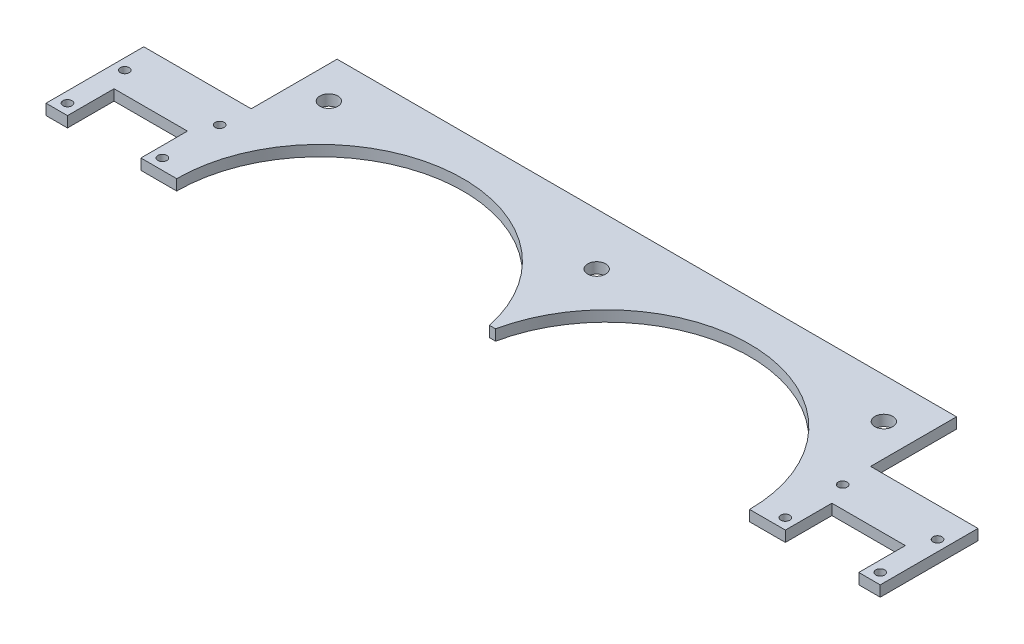
ISO-10303-21;
HEADER;
FILE_DESCRIPTION(('STEP AP214'),'2;1');
FILE_NAME('part.step','',(''),(''),'','','');
FILE_SCHEMA(('AUTOMOTIVE_DESIGN { 1 0 10303 214 1 1 1 1 }'));
ENDSEC;
DATA;
#1=APPLICATION_CONTEXT('core data for automotive mechanical design processes');
#2=APPLICATION_PROTOCOL_DEFINITION('international standard','automotive_design',2000,#1);
#3=PRODUCT_CONTEXT('',#1,'mechanical');
#4=PRODUCT('Part','Part','',(#3));
#5=PRODUCT_RELATED_PRODUCT_CATEGORY('part','',(#4));
#6=PRODUCT_DEFINITION_FORMATION('','',#4);
#7=PRODUCT_DEFINITION_CONTEXT('part definition',#1,'design');
#8=PRODUCT_DEFINITION('design','',#6,#7);
#9=PRODUCT_DEFINITION_SHAPE('','',#8);
#10=(LENGTH_UNIT() NAMED_UNIT(*) SI_UNIT(.MILLI.,.METRE.));
#11=(NAMED_UNIT(*) PLANE_ANGLE_UNIT() SI_UNIT($,.RADIAN.));
#12=(NAMED_UNIT(*) SI_UNIT($,.STERADIAN.) SOLID_ANGLE_UNIT());
#13=UNCERTAINTY_MEASURE_WITH_UNIT(LENGTH_MEASURE(1.E-05),#10,'distance_accuracy_value','');
#14=(GEOMETRIC_REPRESENTATION_CONTEXT(3) GLOBAL_UNCERTAINTY_ASSIGNED_CONTEXT((#13)) GLOBAL_UNIT_ASSIGNED_CONTEXT((#10,
#11,#12)) REPRESENTATION_CONTEXT('',''));
#15=CARTESIAN_POINT('',(0.,0.,0.));
#16=DIRECTION('',(0.,0.,1.));
#17=DIRECTION('',(1.,0.,0.));
#18=AXIS2_PLACEMENT_3D('',#15,#16,#17);
#19=CARTESIAN_POINT('',(37.249673487951,3.,-8.79518226927519));
#20=DIRECTION('',(0.,1.,0.));
#21=DIRECTION('',(0.,0.,1.));
#22=AXIS2_PLACEMENT_3D('',#19,#20,#21);
#23=PLANE('',#22);
#24=CARTESIAN_POINT('',(-89.7503265120491,3.,-27.7951822692752));
#25=DIRECTION('',(0.,1.,0.));
#26=DIRECTION('',(0.,0.,1.));
#27=AXIS2_PLACEMENT_3D('',#24,#25,#26);
#28=CIRCLE('',#27,1.25);
#29=CARTESIAN_POINT('',(-89.7503265120491,3.,-26.5451822692752));
#30=VERTEX_POINT('',#29);
#31=EDGE_CURVE('E422',#30,#30,#28,.T.);
#32=ORIENTED_EDGE('',*,*,#31,.F.);
#33=EDGE_LOOP('',(#32));
#34=FACE_BOUND('',#33,.T.);
#35=CARTESIAN_POINT('',(74.749673487951,3.,-48.7951822692752));
#36=DIRECTION('',(0.,1.,0.));
#37=DIRECTION('',(0.,0.,-1.));
#38=AXIS2_PLACEMENT_3D('',#35,#36,#37);
#39=CIRCLE('',#38,2.50000000000001);
#40=CARTESIAN_POINT('',(74.749673487951,3.,-51.2951822692752));
#41=VERTEX_POINT('',#40);
#42=EDGE_CURVE('E434',#41,#41,#39,.T.);
#43=ORIENTED_EDGE('',*,*,#42,.F.);
#44=EDGE_LOOP('',(#43));
#45=FACE_BOUND('',#44,.T.);
#46=CARTESIAN_POINT('',(84.249673487951,3.,-27.7951822692752));
#47=DIRECTION('',(0.,1.,0.));
#48=DIRECTION('',(0.,0.,-1.));
#49=AXIS2_PLACEMENT_3D('',#46,#47,#48);
#50=CIRCLE('',#49,1.25);
#51=CARTESIAN_POINT('',(84.249673487951,3.,-29.0451822692752));
#52=VERTEX_POINT('',#51);
#53=EDGE_CURVE('E446',#52,#52,#50,.T.);
#54=ORIENTED_EDGE('',*,*,#53,.F.);
#55=EDGE_LOOP('',(#54));
#56=FACE_BOUND('',#55,.T.);
#57=CARTESIAN_POINT('',(-80.2503265120491,3.,-48.7951822692752));
#58=DIRECTION('',(0.,1.,0.));
#59=DIRECTION('',(0.,0.,1.));
#60=AXIS2_PLACEMENT_3D('',#57,#58,#59);
#61=CIRCLE('',#60,2.50000000000001);
#62=CARTESIAN_POINT('',(-80.2503265120491,3.,-46.2951822692752));
#63=VERTEX_POINT('',#62);
#64=EDGE_CURVE('E458',#63,#63,#61,.T.);
#65=ORIENTED_EDGE('',*,*,#64,.F.);
#66=EDGE_LOOP('',(#65));
#67=FACE_BOUND('',#66,.T.);
#68=CARTESIAN_POINT('',(-89.7503265120491,3.,-11.7951822692752));
#69=DIRECTION('',(0.,1.,0.));
#70=DIRECTION('',(0.,0.,1.));
#71=AXIS2_PLACEMENT_3D('',#68,#69,#70);
#72=CIRCLE('',#71,1.25);
#73=CARTESIAN_POINT('',(-89.7503265120491,3.,-10.5451822692752));
#74=VERTEX_POINT('',#73);
#75=EDGE_CURVE('E470',#74,#74,#72,.T.);
#76=ORIENTED_EDGE('',*,*,#75,.F.);
#77=EDGE_LOOP('',(#76));
#78=FACE_BOUND('',#77,.T.);
#79=DIRECTION('',(0.,0.,1.));
#80=VECTOR('',#79,1.);
#81=CARTESIAN_POINT('',(-119.250326512049,3.,-8.79518226927519));
#82=LINE('',#81,#80);
#83=CARTESIAN_POINT('',(-119.250326512049,3.,-36.0990182873039));
#84=VERTEX_POINT('',#83);
#85=CARTESIAN_POINT('',(-119.250326512049,3.,-8.79518226927519));
#86=VERTEX_POINT('',#85);
#87=EDGE_CURVE('E239',#84,#86,#82,.T.);
#88=ORIENTED_EDGE('',*,*,#87,.T.);
#89=DIRECTION('',(1.,0.,0.));
#90=VECTOR('',#89,1.);
#91=CARTESIAN_POINT('',(-119.250326512049,3.,-8.79518226927519));
#92=LINE('',#91,#90);
#93=CARTESIAN_POINT('',(-113.250326512049,3.,-8.79518226927519));
#94=VERTEX_POINT('',#93);
#95=EDGE_CURVE('E127',#86,#94,#92,.T.);
#96=ORIENTED_EDGE('',*,*,#95,.T.);
#97=DIRECTION('',(0.,0.,-1.));
#98=VECTOR('',#97,1.);
#99=CARTESIAN_POINT('',(-113.250326512049,3.,-8.79518226927519));
#100=LINE('',#99,#98);
#101=CARTESIAN_POINT('',(-113.250326512049,3.,-21.7951822692752));
#102=VERTEX_POINT('',#101);
#103=EDGE_CURVE('E290',#94,#102,#100,.T.);
#104=ORIENTED_EDGE('',*,*,#103,.T.);
#105=DIRECTION('',(1.,0.,0.));
#106=VECTOR('',#105,1.);
#107=CARTESIAN_POINT('',(-113.250326512049,3.,-21.7951822692752));
#108=LINE('',#107,#106);
#109=CARTESIAN_POINT('',(-92.7503265120491,3.,-21.7951822692752));
#110=VERTEX_POINT('',#109);
#111=EDGE_CURVE('E309',#102,#110,#108,.T.);
#112=ORIENTED_EDGE('',*,*,#111,.T.);
#113=DIRECTION('',(0.,0.,1.));
#114=VECTOR('',#113,1.);
#115=CARTESIAN_POINT('',(-92.7503265120491,3.,-21.7951822692752));
#116=LINE('',#115,#114);
#117=CARTESIAN_POINT('',(-92.7503265120491,3.,-8.79518226927519));
#118=VERTEX_POINT('',#117);
#119=EDGE_CURVE('E306',#110,#118,#116,.T.);
#120=ORIENTED_EDGE('',*,*,#119,.T.);
#121=DIRECTION('',(1.,0.,0.));
#122=VECTOR('',#121,1.);
#123=CARTESIAN_POINT('',(-92.7503265120491,3.,-8.79518226927519));
#124=LINE('',#123,#122);
#125=CARTESIAN_POINT('',(-82.7503265120491,3.,-8.79518226927519));
#126=VERTEX_POINT('',#125);
#127=EDGE_CURVE('E308',#118,#126,#124,.T.);
#128=ORIENTED_EDGE('',*,*,#127,.T.);
#129=CARTESIAN_POINT('',(-42.7503265120491,3.,-8.79518226927519));
#130=DIRECTION('',(0.,-1.,0.));
#131=DIRECTION('',(0.,0.,-1.));
#132=AXIS2_PLACEMENT_3D('',#129,#130,#131);
#133=CIRCLE('',#132,40.);
#134=CARTESIAN_POINT('',(-3.60098437356102,3.,-17.0006079208551));
#135=VERTEX_POINT('',#134);
#136=EDGE_CURVE('E311',#126,#135,#133,.T.);
#137=ORIENTED_EDGE('',*,*,#136,.T.);
#138=DIRECTION('',(1.,0.,0.));
#139=VECTOR('',#138,1.);
#140=CARTESIAN_POINT('',(-3.60098437356102,3.,-17.000607920855));
#141=LINE('',#140,#139);
#142=CARTESIAN_POINT('',(-1.8996686505371,3.,-17.000607920855));
#143=VERTEX_POINT('',#142);
#144=EDGE_CURVE('E317',#135,#143,#141,.T.);
#145=ORIENTED_EDGE('',*,*,#144,.T.);
#146=CARTESIAN_POINT('',(37.249673487951,3.,-8.79518226927519));
#147=DIRECTION('',(0.,-1.,0.));
#148=DIRECTION('',(0.,0.,1.));
#149=AXIS2_PLACEMENT_3D('',#146,#147,#148);
#150=CIRCLE('',#149,40.);
#151=CARTESIAN_POINT('',(77.2496734879509,3.,-8.79518226927519));
#152=VERTEX_POINT('',#151);
#153=EDGE_CURVE('E319',#143,#152,#150,.T.);
#154=ORIENTED_EDGE('',*,*,#153,.T.);
#155=DIRECTION('',(1.,0.,0.));
#156=VECTOR('',#155,1.);
#157=CARTESIAN_POINT('',(87.249673487951,3.,-8.79518226927519));
#158=LINE('',#157,#156);
#159=CARTESIAN_POINT('',(87.249673487951,3.,-8.79518226927519));
#160=VERTEX_POINT('',#159);
#161=EDGE_CURVE('E321',#152,#160,#158,.T.);
#162=ORIENTED_EDGE('',*,*,#161,.T.);
#163=DIRECTION('',(0.,0.,-1.));
#164=VECTOR('',#163,1.);
#165=CARTESIAN_POINT('',(87.249673487951,3.,-21.7951822692752));
#166=LINE('',#165,#164);
#167=CARTESIAN_POINT('',(87.249673487951,3.,-21.7951822692752));
#168=VERTEX_POINT('',#167);
#169=EDGE_CURVE('E323',#160,#168,#166,.T.);
#170=ORIENTED_EDGE('',*,*,#169,.T.);
#171=DIRECTION('',(1.,0.,0.));
#172=VECTOR('',#171,1.);
#173=CARTESIAN_POINT('',(107.749673487951,3.,-21.7951822692752));
#174=LINE('',#173,#172);
#175=CARTESIAN_POINT('',(107.749673487951,3.,-21.7951822692752));
#176=VERTEX_POINT('',#175);
#177=EDGE_CURVE('E325',#168,#176,#174,.T.);
#178=ORIENTED_EDGE('',*,*,#177,.T.);
#179=DIRECTION('',(0.,0.,1.));
#180=VECTOR('',#179,1.);
#181=CARTESIAN_POINT('',(107.749673487951,3.,-8.79518226927519));
#182=LINE('',#181,#180);
#183=CARTESIAN_POINT('',(107.749673487951,3.,-8.79518226927519));
#184=VERTEX_POINT('',#183);
#185=EDGE_CURVE('E327',#176,#184,#182,.T.);
#186=ORIENTED_EDGE('',*,*,#185,.T.);
#187=DIRECTION('',(1.,0.,0.));
#188=VECTOR('',#187,1.);
#189=CARTESIAN_POINT('',(113.749673487951,3.,-8.79518226927519));
#190=LINE('',#189,#188);
#191=CARTESIAN_POINT('',(113.749673487951,3.,-8.79518226927519));
#192=VERTEX_POINT('',#191);
#193=EDGE_CURVE('E329',#184,#192,#190,.T.);
#194=ORIENTED_EDGE('',*,*,#193,.T.);
#195=DIRECTION('',(0.,0.,-1.));
#196=VECTOR('',#195,1.);
#197=CARTESIAN_POINT('',(113.749673487951,3.,-8.79518226927519));
#198=LINE('',#197,#196);
#199=CARTESIAN_POINT('',(113.749673487951,3.,-36.0990182873039));
#200=VERTEX_POINT('',#199);
#201=EDGE_CURVE('E331',#192,#200,#198,.T.);
#202=ORIENTED_EDGE('',*,*,#201,.T.);
#203=DIRECTION('',(-1.,0.,0.));
#204=VECTOR('',#203,1.);
#205=CARTESIAN_POINT('',(113.749673487951,3.,-36.0990182873039));
#206=LINE('',#205,#204);
#207=CARTESIAN_POINT('',(83.749673487951,3.,-36.0990182873039));
#208=VERTEX_POINT('',#207);
#209=EDGE_CURVE('E333',#200,#208,#206,.T.);
#210=ORIENTED_EDGE('',*,*,#209,.T.);
#211=DIRECTION('',(0.,0.,-1.));
#212=VECTOR('',#211,1.);
#213=CARTESIAN_POINT('',(83.749673487951,3.,-36.0990182873039));
#214=LINE('',#213,#212);
#215=CARTESIAN_POINT('',(83.749673487951,3.,-60.0990182873039));
#216=VERTEX_POINT('',#215);
#217=EDGE_CURVE('E182',#208,#216,#214,.T.);
#218=ORIENTED_EDGE('',*,*,#217,.T.);
#219=DIRECTION('',(-1.,0.,0.));
#220=VECTOR('',#219,1.);
#221=CARTESIAN_POINT('',(-89.2503265120491,3.,-60.0990182873039));
#222=LINE('',#221,#220);
#223=CARTESIAN_POINT('',(-89.2503265120491,3.,-60.0990182873039));
#224=VERTEX_POINT('',#223);
#225=EDGE_CURVE('E176',#216,#224,#222,.T.);
#226=ORIENTED_EDGE('',*,*,#225,.T.);
#227=DIRECTION('',(0.,0.,1.));
#228=VECTOR('',#227,1.);
#229=CARTESIAN_POINT('',(-89.2503265120491,3.,-36.0990182873039));
#230=LINE('',#229,#228);
#231=CARTESIAN_POINT('',(-89.2503265120491,3.,-36.0990182873039));
#232=VERTEX_POINT('',#231);
#233=EDGE_CURVE('E180',#224,#232,#230,.T.);
#234=ORIENTED_EDGE('',*,*,#233,.T.);
#235=DIRECTION('',(-1.,0.,0.));
#236=VECTOR('',#235,1.);
#237=CARTESIAN_POINT('',(-119.250326512049,3.,-36.0990182873039));
#238=LINE('',#237,#236);
#239=EDGE_CURVE('E48',#232,#84,#238,.T.);
#240=ORIENTED_EDGE('',*,*,#239,.T.);
#241=EDGE_LOOP('',(#88,#96,#104,#112,#120,#128,#137,#145,#154,#162,#170,#178,#186,#194,#202,
#210,#218,#226,#234,#240));
#242=FACE_BOUND('',#241,.T.);
#243=CARTESIAN_POINT('',(84.249673487951,3.,-11.7951822692752));
#244=DIRECTION('',(0.,1.,0.));
#245=DIRECTION('',(0.,0.,-1.));
#246=AXIS2_PLACEMENT_3D('',#243,#244,#245);
#247=CIRCLE('',#246,1.25);
#248=CARTESIAN_POINT('',(84.249673487951,3.,-13.0451822692752));
#249=VERTEX_POINT('',#248);
#250=EDGE_CURVE('E204',#249,#249,#247,.T.);
#251=ORIENTED_EDGE('',*,*,#250,.F.);
#252=EDGE_LOOP('',(#251));
#253=FACE_BOUND('',#252,.T.);
#254=CARTESIAN_POINT('',(-2.25032651204908,3.,-45.5990182873039));
#255=DIRECTION('',(0.,1.,0.));
#256=DIRECTION('',(0.,0.,1.));
#257=AXIS2_PLACEMENT_3D('',#254,#255,#256);
#258=CIRCLE('',#257,2.5);
#259=CARTESIAN_POINT('',(-2.25032651204908,3.,-43.0990182873039));
#260=VERTEX_POINT('',#259);
#261=EDGE_CURVE('E464',#260,#260,#258,.T.);
#262=ORIENTED_EDGE('',*,*,#261,.F.);
#263=EDGE_LOOP('',(#262));
#264=FACE_BOUND('',#263,.T.);
#265=CARTESIAN_POINT('',(110.749673487951,3.,-11.7951822692752));
#266=DIRECTION('',(0.,1.,0.));
#267=DIRECTION('',(0.,0.,-1.));
#268=AXIS2_PLACEMENT_3D('',#265,#266,#267);
#269=CIRCLE('',#268,1.25000000000001);
#270=CARTESIAN_POINT('',(110.749673487951,3.,-13.0451822692752));
#271=VERTEX_POINT('',#270);
#272=EDGE_CURVE('E452',#271,#271,#269,.T.);
#273=ORIENTED_EDGE('',*,*,#272,.F.);
#274=EDGE_LOOP('',(#273));
#275=FACE_BOUND('',#274,.T.);
#276=CARTESIAN_POINT('',(110.749673487951,3.,-27.7951822692752));
#277=DIRECTION('',(0.,1.,0.));
#278=DIRECTION('',(0.,0.,-1.));
#279=AXIS2_PLACEMENT_3D('',#276,#277,#278);
#280=CIRCLE('',#279,1.25000000000001);
#281=CARTESIAN_POINT('',(110.749673487951,3.,-29.0451822692752));
#282=VERTEX_POINT('',#281);
#283=EDGE_CURVE('E440',#282,#282,#280,.T.);
#284=ORIENTED_EDGE('',*,*,#283,.F.);
#285=EDGE_LOOP('',(#284));
#286=FACE_BOUND('',#285,.T.);
#287=CARTESIAN_POINT('',(-116.250326512049,3.,-27.7951822692752));
#288=DIRECTION('',(0.,1.,0.));
#289=DIRECTION('',(0.,0.,1.));
#290=AXIS2_PLACEMENT_3D('',#287,#288,#289);
#291=CIRCLE('',#290,1.25000000000001);
#292=CARTESIAN_POINT('',(-116.250326512049,3.,-26.5451822692752));
#293=VERTEX_POINT('',#292);
#294=EDGE_CURVE('E428',#293,#293,#291,.T.);
#295=ORIENTED_EDGE('',*,*,#294,.F.);
#296=EDGE_LOOP('',(#295));
#297=FACE_BOUND('',#296,.T.);
#298=CARTESIAN_POINT('',(-116.250326512049,3.,-11.7951822692752));
#299=DIRECTION('',(0.,1.,0.));
#300=DIRECTION('',(0.,0.,1.));
#301=AXIS2_PLACEMENT_3D('',#298,#299,#300);
#302=CIRCLE('',#301,1.25000000000001);
#303=CARTESIAN_POINT('',(-116.250326512049,3.,-10.5451822692752));
#304=VERTEX_POINT('',#303);
#305=EDGE_CURVE('E413',#304,#304,#302,.T.);
#306=ORIENTED_EDGE('',*,*,#305,.F.);
#307=EDGE_LOOP('',(#306));
#308=FACE_BOUND('',#307,.T.);
#309=ADVANCED_FACE('F31',(#34,#45,#56,#67,#78,#242,#253,#264,#275,#286,#297,#308),#23,.T.);
#310=CARTESIAN_POINT('',(37.249673487951,0.,-8.79518226927519));
#311=DIRECTION('',(0.,1.,0.));
#312=DIRECTION('',(0.,0.,1.));
#313=AXIS2_PLACEMENT_3D('',#310,#311,#312);
#314=PLANE('',#313);
#315=CARTESIAN_POINT('',(-89.7503265120491,0.,-27.7951822692752));
#316=DIRECTION('',(0.,1.,0.));
#317=DIRECTION('',(0.,0.,1.));
#318=AXIS2_PLACEMENT_3D('',#315,#316,#317);
#319=CIRCLE('',#318,1.25);
#320=CARTESIAN_POINT('',(-89.7503265120491,0.,-26.5451822692752));
#321=VERTEX_POINT('',#320);
#322=EDGE_CURVE('E419',#321,#321,#319,.T.);
#323=ORIENTED_EDGE('',*,*,#322,.T.);
#324=EDGE_LOOP('',(#323));
#325=FACE_BOUND('',#324,.T.);
#326=CARTESIAN_POINT('',(74.749673487951,0.,-48.7951822692752));
#327=DIRECTION('',(0.,1.,0.));
#328=DIRECTION('',(0.,0.,-1.));
#329=AXIS2_PLACEMENT_3D('',#326,#327,#328);
#330=CIRCLE('',#329,2.50000000000001);
#331=CARTESIAN_POINT('',(74.749673487951,0.,-51.2951822692752));
#332=VERTEX_POINT('',#331);
#333=EDGE_CURVE('E431',#332,#332,#330,.T.);
#334=ORIENTED_EDGE('',*,*,#333,.T.);
#335=EDGE_LOOP('',(#334));
#336=FACE_BOUND('',#335,.T.);
#337=CARTESIAN_POINT('',(84.249673487951,0.,-27.7951822692752));
#338=DIRECTION('',(0.,1.,0.));
#339=DIRECTION('',(0.,0.,-1.));
#340=AXIS2_PLACEMENT_3D('',#337,#338,#339);
#341=CIRCLE('',#340,1.25);
#342=CARTESIAN_POINT('',(84.249673487951,0.,-29.0451822692752));
#343=VERTEX_POINT('',#342);
#344=EDGE_CURVE('E443',#343,#343,#341,.T.);
#345=ORIENTED_EDGE('',*,*,#344,.T.);
#346=EDGE_LOOP('',(#345));
#347=FACE_BOUND('',#346,.T.);
#348=CARTESIAN_POINT('',(-80.2503265120491,0.,-48.7951822692752));
#349=DIRECTION('',(0.,1.,0.));
#350=DIRECTION('',(0.,0.,1.));
#351=AXIS2_PLACEMENT_3D('',#348,#349,#350);
#352=CIRCLE('',#351,2.50000000000001);
#353=CARTESIAN_POINT('',(-80.2503265120491,0.,-46.2951822692752));
#354=VERTEX_POINT('',#353);
#355=EDGE_CURVE('E455',#354,#354,#352,.T.);
#356=ORIENTED_EDGE('',*,*,#355,.T.);
#357=EDGE_LOOP('',(#356));
#358=FACE_BOUND('',#357,.T.);
#359=CARTESIAN_POINT('',(-89.7503265120491,0.,-11.7951822692752));
#360=DIRECTION('',(0.,1.,0.));
#361=DIRECTION('',(0.,0.,1.));
#362=AXIS2_PLACEMENT_3D('',#359,#360,#361);
#363=CIRCLE('',#362,1.25);
#364=CARTESIAN_POINT('',(-89.7503265120491,0.,-10.5451822692752));
#365=VERTEX_POINT('',#364);
#366=EDGE_CURVE('E467',#365,#365,#363,.T.);
#367=ORIENTED_EDGE('',*,*,#366,.T.);
#368=EDGE_LOOP('',(#367));
#369=FACE_BOUND('',#368,.T.);
#370=DIRECTION('',(0.,0.,1.));
#371=VECTOR('',#370,1.);
#372=CARTESIAN_POINT('',(-119.250326512049,0.,-8.79518226927519));
#373=LINE('',#372,#371);
#374=CARTESIAN_POINT('',(-119.250326512049,0.,-36.0990182873039));
#375=VERTEX_POINT('',#374);
#376=CARTESIAN_POINT('',(-119.250326512049,0.,-8.79518226927519));
#377=VERTEX_POINT('',#376);
#378=EDGE_CURVE('E200',#375,#377,#373,.T.);
#379=ORIENTED_EDGE('',*,*,#378,.F.);
#380=DIRECTION('',(-1.,0.,0.));
#381=VECTOR('',#380,1.);
#382=CARTESIAN_POINT('',(-119.250326512049,0.,-36.0990182873039));
#383=LINE('',#382,#381);
#384=CARTESIAN_POINT('',(-89.2503265120491,0.,-36.0990182873039));
#385=VERTEX_POINT('',#384);
#386=EDGE_CURVE('E119',#385,#375,#383,.T.);
#387=ORIENTED_EDGE('',*,*,#386,.F.);
#388=DIRECTION('',(0.,0.,1.));
#389=VECTOR('',#388,1.);
#390=CARTESIAN_POINT('',(-89.2503265120491,0.,-36.0990182873039));
#391=LINE('',#390,#389);
#392=CARTESIAN_POINT('',(-89.2503265120491,0.,-60.0990182873039));
#393=VERTEX_POINT('',#392);
#394=EDGE_CURVE('E113',#393,#385,#391,.T.);
#395=ORIENTED_EDGE('',*,*,#394,.F.);
#396=DIRECTION('',(-1.,0.,0.));
#397=VECTOR('',#396,1.);
#398=CARTESIAN_POINT('',(-89.2503265120491,0.,-60.0990182873039));
#399=LINE('',#398,#397);
#400=CARTESIAN_POINT('',(83.749673487951,0.,-60.0990182873039));
#401=VERTEX_POINT('',#400);
#402=EDGE_CURVE('E190',#401,#393,#399,.T.);
#403=ORIENTED_EDGE('',*,*,#402,.F.);
#404=DIRECTION('',(0.,0.,-1.));
#405=VECTOR('',#404,1.);
#406=CARTESIAN_POINT('',(83.749673487951,0.,-36.0990182873039));
#407=LINE('',#406,#405);
#408=CARTESIAN_POINT('',(83.749673487951,0.,-36.0990182873039));
#409=VERTEX_POINT('',#408);
#410=EDGE_CURVE('E234',#409,#401,#407,.T.);
#411=ORIENTED_EDGE('',*,*,#410,.F.);
#412=DIRECTION('',(-1.,0.,0.));
#413=VECTOR('',#412,1.);
#414=CARTESIAN_POINT('',(113.749673487951,0.,-36.0990182873039));
#415=LINE('',#414,#413);
#416=CARTESIAN_POINT('',(113.749673487951,0.,-36.0990182873039));
#417=VERTEX_POINT('',#416);
#418=EDGE_CURVE('E232',#417,#409,#415,.T.);
#419=ORIENTED_EDGE('',*,*,#418,.F.);
#420=DIRECTION('',(0.,0.,-1.));
#421=VECTOR('',#420,1.);
#422=CARTESIAN_POINT('',(113.749673487951,0.,-8.79518226927519));
#423=LINE('',#422,#421);
#424=CARTESIAN_POINT('',(113.749673487951,0.,-8.79518226927519));
#425=VERTEX_POINT('',#424);
#426=EDGE_CURVE('E230',#425,#417,#423,.T.);
#427=ORIENTED_EDGE('',*,*,#426,.F.);
#428=DIRECTION('',(1.,0.,0.));
#429=VECTOR('',#428,1.);
#430=CARTESIAN_POINT('',(113.749673487951,0.,-8.79518226927519));
#431=LINE('',#430,#429);
#432=CARTESIAN_POINT('',(107.749673487951,0.,-8.79518226927519));
#433=VERTEX_POINT('',#432);
#434=EDGE_CURVE('E228',#433,#425,#431,.T.);
#435=ORIENTED_EDGE('',*,*,#434,.F.);
#436=DIRECTION('',(0.,0.,1.));
#437=VECTOR('',#436,1.);
#438=CARTESIAN_POINT('',(107.749673487951,0.,-8.79518226927519));
#439=LINE('',#438,#437);
#440=CARTESIAN_POINT('',(107.749673487951,0.,-21.7951822692752));
#441=VERTEX_POINT('',#440);
#442=EDGE_CURVE('E226',#441,#433,#439,.T.);
#443=ORIENTED_EDGE('',*,*,#442,.F.);
#444=DIRECTION('',(1.,0.,0.));
#445=VECTOR('',#444,1.);
#446=CARTESIAN_POINT('',(107.749673487951,0.,-21.7951822692752));
#447=LINE('',#446,#445);
#448=CARTESIAN_POINT('',(87.249673487951,0.,-21.7951822692752));
#449=VERTEX_POINT('',#448);
#450=EDGE_CURVE('E224',#449,#441,#447,.T.);
#451=ORIENTED_EDGE('',*,*,#450,.F.);
#452=DIRECTION('',(0.,0.,-1.));
#453=VECTOR('',#452,1.);
#454=CARTESIAN_POINT('',(87.249673487951,0.,-21.7951822692752));
#455=LINE('',#454,#453);
#456=CARTESIAN_POINT('',(87.249673487951,0.,-8.79518226927519));
#457=VERTEX_POINT('',#456);
#458=EDGE_CURVE('E222',#457,#449,#455,.T.);
#459=ORIENTED_EDGE('',*,*,#458,.F.);
#460=DIRECTION('',(1.,0.,0.));
#461=VECTOR('',#460,1.);
#462=CARTESIAN_POINT('',(87.249673487951,0.,-8.79518226927519));
#463=LINE('',#462,#461);
#464=CARTESIAN_POINT('',(77.2496734879509,0.,-8.79518226927519));
#465=VERTEX_POINT('',#464);
#466=EDGE_CURVE('E220',#465,#457,#463,.T.);
#467=ORIENTED_EDGE('',*,*,#466,.F.);
#468=CARTESIAN_POINT('',(37.249673487951,0.,-8.79518226927519));
#469=DIRECTION('',(0.,-1.,0.));
#470=DIRECTION('',(0.,0.,1.));
#471=AXIS2_PLACEMENT_3D('',#468,#469,#470);
#472=CIRCLE('',#471,40.);
#473=CARTESIAN_POINT('',(-1.8996686505371,0.,-17.000607920855));
#474=VERTEX_POINT('',#473);
#475=EDGE_CURVE('E218',#474,#465,#472,.T.);
#476=ORIENTED_EDGE('',*,*,#475,.F.);
#477=DIRECTION('',(1.,0.,0.));
#478=VECTOR('',#477,1.);
#479=CARTESIAN_POINT('',(-3.60098437356102,0.,-17.000607920855));
#480=LINE('',#479,#478);
#481=CARTESIAN_POINT('',(-3.60098437356102,0.,-17.0006079208551));
#482=VERTEX_POINT('',#481);
#483=EDGE_CURVE('E216',#482,#474,#480,.T.);
#484=ORIENTED_EDGE('',*,*,#483,.F.);
#485=CARTESIAN_POINT('',(-42.7503265120491,0.,-8.79518226927519));
#486=DIRECTION('',(0.,-1.,0.));
#487=DIRECTION('',(0.,0.,-1.));
#488=AXIS2_PLACEMENT_3D('',#485,#486,#487);
#489=CIRCLE('',#488,40.);
#490=CARTESIAN_POINT('',(-82.7503265120491,0.,-8.79518226927519));
#491=VERTEX_POINT('',#490);
#492=EDGE_CURVE('E214',#491,#482,#489,.T.);
#493=ORIENTED_EDGE('',*,*,#492,.F.);
#494=DIRECTION('',(1.,0.,0.));
#495=VECTOR('',#494,1.);
#496=CARTESIAN_POINT('',(-92.7503265120491,0.,-8.79518226927519));
#497=LINE('',#496,#495);
#498=CARTESIAN_POINT('',(-92.7503265120491,0.,-8.79518226927519));
#499=VERTEX_POINT('',#498);
#500=EDGE_CURVE('E212',#499,#491,#497,.T.);
#501=ORIENTED_EDGE('',*,*,#500,.F.);
#502=DIRECTION('',(0.,0.,1.));
#503=VECTOR('',#502,1.);
#504=CARTESIAN_POINT('',(-92.7503265120491,0.,-21.7951822692752));
#505=LINE('',#504,#503);
#506=CARTESIAN_POINT('',(-92.7503265120491,0.,-21.7951822692752));
#507=VERTEX_POINT('',#506);
#508=EDGE_CURVE('E210',#507,#499,#505,.T.);
#509=ORIENTED_EDGE('',*,*,#508,.F.);
#510=DIRECTION('',(1.,0.,0.));
#511=VECTOR('',#510,1.);
#512=CARTESIAN_POINT('',(-113.250326512049,0.,-21.7951822692752));
#513=LINE('',#512,#511);
#514=CARTESIAN_POINT('',(-113.250326512049,0.,-21.7951822692752));
#515=VERTEX_POINT('',#514);
#516=EDGE_CURVE('E208',#515,#507,#513,.T.);
#517=ORIENTED_EDGE('',*,*,#516,.F.);
#518=DIRECTION('',(0.,0.,-1.));
#519=VECTOR('',#518,1.);
#520=CARTESIAN_POINT('',(-113.250326512049,0.,-8.79518226927519));
#521=LINE('',#520,#519);
#522=CARTESIAN_POINT('',(-113.250326512049,0.,-8.79518226927519));
#523=VERTEX_POINT('',#522);
#524=EDGE_CURVE('E206',#523,#515,#521,.T.);
#525=ORIENTED_EDGE('',*,*,#524,.F.);
#526=DIRECTION('',(1.,0.,0.));
#527=VECTOR('',#526,1.);
#528=CARTESIAN_POINT('',(-119.250326512049,0.,-8.79518226927519));
#529=LINE('',#528,#527);
#530=EDGE_CURVE('E203',#377,#523,#529,.T.);
#531=ORIENTED_EDGE('',*,*,#530,.F.);
#532=EDGE_LOOP('',(#379,#387,#395,#403,#411,#419,#427,#435,#443,#451,#459,#467,#476,#484,#493,
#501,#509,#517,#525,#531));
#533=FACE_BOUND('',#532,.T.);
#534=CARTESIAN_POINT('',(84.249673487951,0.,-11.7951822692752));
#535=DIRECTION('',(0.,1.,0.));
#536=DIRECTION('',(0.,0.,-1.));
#537=AXIS2_PLACEMENT_3D('',#534,#535,#536);
#538=CIRCLE('',#537,1.25);
#539=CARTESIAN_POINT('',(84.249673487951,0.,-13.0451822692752));
#540=VERTEX_POINT('',#539);
#541=EDGE_CURVE('E473',#540,#540,#538,.T.);
#542=ORIENTED_EDGE('',*,*,#541,.T.);
#543=EDGE_LOOP('',(#542));
#544=FACE_BOUND('',#543,.T.);
#545=CARTESIAN_POINT('',(-2.25032651204908,0.,-45.5990182873039));
#546=DIRECTION('',(0.,1.,0.));
#547=DIRECTION('',(0.,0.,1.));
#548=AXIS2_PLACEMENT_3D('',#545,#546,#547);
#549=CIRCLE('',#548,2.5);
#550=CARTESIAN_POINT('',(-2.25032651204908,0.,-43.0990182873039));
#551=VERTEX_POINT('',#550);
#552=EDGE_CURVE('E461',#551,#551,#549,.T.);
#553=ORIENTED_EDGE('',*,*,#552,.T.);
#554=EDGE_LOOP('',(#553));
#555=FACE_BOUND('',#554,.T.);
#556=CARTESIAN_POINT('',(110.749673487951,0.,-11.7951822692752));
#557=DIRECTION('',(0.,1.,0.));
#558=DIRECTION('',(0.,0.,-1.));
#559=AXIS2_PLACEMENT_3D('',#556,#557,#558);
#560=CIRCLE('',#559,1.25000000000001);
#561=CARTESIAN_POINT('',(110.749673487951,0.,-13.0451822692752));
#562=VERTEX_POINT('',#561);
#563=EDGE_CURVE('E449',#562,#562,#560,.T.);
#564=ORIENTED_EDGE('',*,*,#563,.T.);
#565=EDGE_LOOP('',(#564));
#566=FACE_BOUND('',#565,.T.);
#567=CARTESIAN_POINT('',(110.749673487951,0.,-27.7951822692752));
#568=DIRECTION('',(0.,1.,0.));
#569=DIRECTION('',(0.,0.,-1.));
#570=AXIS2_PLACEMENT_3D('',#567,#568,#569);
#571=CIRCLE('',#570,1.25000000000001);
#572=CARTESIAN_POINT('',(110.749673487951,0.,-29.0451822692752));
#573=VERTEX_POINT('',#572);
#574=EDGE_CURVE('E437',#573,#573,#571,.T.);
#575=ORIENTED_EDGE('',*,*,#574,.T.);
#576=EDGE_LOOP('',(#575));
#577=FACE_BOUND('',#576,.T.);
#578=CARTESIAN_POINT('',(-116.250326512049,0.,-27.7951822692752));
#579=DIRECTION('',(0.,1.,0.));
#580=DIRECTION('',(0.,0.,1.));
#581=AXIS2_PLACEMENT_3D('',#578,#579,#580);
#582=CIRCLE('',#581,1.25000000000001);
#583=CARTESIAN_POINT('',(-116.250326512049,0.,-26.5451822692752));
#584=VERTEX_POINT('',#583);
#585=EDGE_CURVE('E425',#584,#584,#582,.T.);
#586=ORIENTED_EDGE('',*,*,#585,.T.);
#587=EDGE_LOOP('',(#586));
#588=FACE_BOUND('',#587,.T.);
#589=CARTESIAN_POINT('',(-116.250326512049,0.,-11.7951822692752));
#590=DIRECTION('',(0.,1.,0.));
#591=DIRECTION('',(0.,0.,1.));
#592=AXIS2_PLACEMENT_3D('',#589,#590,#591);
#593=CIRCLE('',#592,1.25000000000001);
#594=CARTESIAN_POINT('',(-116.250326512049,0.,-10.5451822692752));
#595=VERTEX_POINT('',#594);
#596=EDGE_CURVE('E416',#595,#595,#593,.T.);
#597=ORIENTED_EDGE('',*,*,#596,.T.);
#598=EDGE_LOOP('',(#597));
#599=FACE_BOUND('',#598,.T.);
#600=ADVANCED_FACE('F294',(#325,#336,#347,#358,#369,#533,#544,#555,#566,#577,#588,#599),#314,.F.);
#601=CARTESIAN_POINT('',(-119.250326512049,3.,-8.79518226927519));
#602=DIRECTION('',(1.,0.,0.));
#603=DIRECTION('',(0.,0.,-1.));
#604=AXIS2_PLACEMENT_3D('',#601,#602,#603);
#605=PLANE('',#604);
#606=ORIENTED_EDGE('',*,*,#378,.T.);
#607=DIRECTION('',(0.,-1.,0.));
#608=VECTOR('',#607,1.);
#609=CARTESIAN_POINT('',(-119.250326512049,3.,-8.79518226927519));
#610=LINE('',#609,#608);
#611=EDGE_CURVE('E11',#86,#377,#610,.T.);
#612=ORIENTED_EDGE('',*,*,#611,.F.);
#613=ORIENTED_EDGE('',*,*,#87,.F.);
#614=DIRECTION('',(0.,-1.,0.));
#615=VECTOR('',#614,1.);
#616=CARTESIAN_POINT('',(-119.250326512049,3.,-36.0990182873039));
#617=LINE('',#616,#615);
#618=EDGE_CURVE('E196',#84,#375,#617,.T.);
#619=ORIENTED_EDGE('',*,*,#618,.T.);
#620=EDGE_LOOP('',(#606,#612,#613,#619));
#621=FACE_BOUND('',#620,.T.);
#622=ADVANCED_FACE('F33',(#621),#605,.F.);
#623=CARTESIAN_POINT('',(-119.250326512049,3.,-8.79518226927519));
#624=DIRECTION('',(0.,0.,-1.));
#625=DIRECTION('',(-1.,0.,0.));
#626=AXIS2_PLACEMENT_3D('',#623,#624,#625);
#627=PLANE('',#626);
#628=ORIENTED_EDGE('',*,*,#530,.T.);
#629=DIRECTION('',(0.,-1.,0.));
#630=VECTOR('',#629,1.);
#631=CARTESIAN_POINT('',(-113.250326512049,3.,-8.79518226927519));
#632=LINE('',#631,#630);
#633=EDGE_CURVE('E40',#94,#523,#632,.T.);
#634=ORIENTED_EDGE('',*,*,#633,.F.);
#635=ORIENTED_EDGE('',*,*,#95,.F.);
#636=ORIENTED_EDGE('',*,*,#611,.T.);
#637=EDGE_LOOP('',(#628,#634,#635,#636));
#638=FACE_BOUND('',#637,.T.);
#639=ADVANCED_FACE('F725',(#638),#627,.F.);
#640=CARTESIAN_POINT('',(-113.250326512049,3.,-8.79518226927519));
#641=DIRECTION('',(-1.,0.,0.));
#642=DIRECTION('',(0.,0.,1.));
#643=AXIS2_PLACEMENT_3D('',#640,#641,#642);
#644=PLANE('',#643);
#645=ORIENTED_EDGE('',*,*,#524,.T.);
#646=DIRECTION('',(0.,-1.,0.));
#647=VECTOR('',#646,1.);
#648=CARTESIAN_POINT('',(-113.250326512049,3.,-21.7951822692752));
#649=LINE('',#648,#647);
#650=EDGE_CURVE('E282',#102,#515,#649,.T.);
#651=ORIENTED_EDGE('',*,*,#650,.F.);
#652=ORIENTED_EDGE('',*,*,#103,.F.);
#653=ORIENTED_EDGE('',*,*,#633,.T.);
#654=EDGE_LOOP('',(#645,#651,#652,#653));
#655=FACE_BOUND('',#654,.T.);
#656=ADVANCED_FACE('F288',(#655),#644,.F.);
#657=CARTESIAN_POINT('',(-113.250326512049,3.,-21.7951822692752));
#658=DIRECTION('',(0.,0.,-1.));
#659=DIRECTION('',(-1.,0.,0.));
#660=AXIS2_PLACEMENT_3D('',#657,#658,#659);
#661=PLANE('',#660);
#662=ORIENTED_EDGE('',*,*,#516,.T.);
#663=DIRECTION('',(0.,-1.,0.));
#664=VECTOR('',#663,1.);
#665=CARTESIAN_POINT('',(-92.7503265120491,3.,-21.7951822692752));
#666=LINE('',#665,#664);
#667=EDGE_CURVE('E279',#110,#507,#666,.T.);
#668=ORIENTED_EDGE('',*,*,#667,.F.);
#669=ORIENTED_EDGE('',*,*,#111,.F.);
#670=ORIENTED_EDGE('',*,*,#650,.T.);
#671=EDGE_LOOP('',(#662,#668,#669,#670));
#672=FACE_BOUND('',#671,.T.);
#673=ADVANCED_FACE('F300',(#672),#661,.F.);
#674=CARTESIAN_POINT('',(-92.7503265120491,3.,-21.7951822692752));
#675=DIRECTION('',(1.,0.,0.));
#676=DIRECTION('',(0.,0.,-1.));
#677=AXIS2_PLACEMENT_3D('',#674,#675,#676);
#678=PLANE('',#677);
#679=ORIENTED_EDGE('',*,*,#508,.T.);
#680=DIRECTION('',(0.,-1.,0.));
#681=VECTOR('',#680,1.);
#682=CARTESIAN_POINT('',(-92.7503265120491,3.,-8.79518226927519));
#683=LINE('',#682,#681);
#684=EDGE_CURVE('E276',#118,#499,#683,.T.);
#685=ORIENTED_EDGE('',*,*,#684,.F.);
#686=ORIENTED_EDGE('',*,*,#119,.F.);
#687=ORIENTED_EDGE('',*,*,#667,.T.);
#688=EDGE_LOOP('',(#679,#685,#686,#687));
#689=FACE_BOUND('',#688,.T.);
#690=ADVANCED_FACE('F304',(#689),#678,.F.);
#691=CARTESIAN_POINT('',(-92.7503265120491,3.,-8.79518226927519));
#692=DIRECTION('',(0.,0.,-1.));
#693=DIRECTION('',(-1.,0.,0.));
#694=AXIS2_PLACEMENT_3D('',#691,#692,#693);
#695=PLANE('',#694);
#696=ORIENTED_EDGE('',*,*,#500,.T.);
#697=DIRECTION('',(0.,-1.,0.));
#698=VECTOR('',#697,1.);
#699=CARTESIAN_POINT('',(-82.7503265120491,3.,-8.79518226927519));
#700=LINE('',#699,#698);
#701=EDGE_CURVE('E273',#126,#491,#700,.T.);
#702=ORIENTED_EDGE('',*,*,#701,.F.);
#703=ORIENTED_EDGE('',*,*,#127,.F.);
#704=ORIENTED_EDGE('',*,*,#684,.T.);
#705=EDGE_LOOP('',(#696,#702,#703,#704));
#706=FACE_BOUND('',#705,.T.);
#707=ADVANCED_FACE('F690',(#706),#695,.F.);
#708=CARTESIAN_POINT('',(-42.7503265120491,3.,-8.79518226927519));
#709=DIRECTION('',(0.,-1.,0.));
#710=DIRECTION('',(0.,0.,-1.));
#711=AXIS2_PLACEMENT_3D('',#708,#709,#710);
#712=CYLINDRICAL_SURFACE('',#711,40.);
#713=ORIENTED_EDGE('',*,*,#492,.T.);
#714=DIRECTION('',(0.,-1.,0.));
#715=VECTOR('',#714,1.);
#716=CARTESIAN_POINT('',(-3.60098437356102,3.,-17.0006079208551));
#717=LINE('',#716,#715);
#718=EDGE_CURVE('E270',#135,#482,#717,.T.);
#719=ORIENTED_EDGE('',*,*,#718,.F.);
#720=ORIENTED_EDGE('',*,*,#136,.F.);
#721=ORIENTED_EDGE('',*,*,#701,.T.);
#722=EDGE_LOOP('',(#713,#719,#720,#721));
#723=FACE_BOUND('',#722,.T.);
#724=ADVANCED_FACE('F680',(#723),#712,.F.);
#725=CARTESIAN_POINT('',(-3.60098437356102,3.,-17.000607920855));
#726=DIRECTION('',(0.,0.,-1.));
#727=DIRECTION('',(-1.,0.,0.));
#728=AXIS2_PLACEMENT_3D('',#725,#726,#727);
#729=PLANE('',#728);
#730=ORIENTED_EDGE('',*,*,#483,.T.);
#731=DIRECTION('',(0.,-1.,0.));
#732=VECTOR('',#731,1.);
#733=CARTESIAN_POINT('',(-1.8996686505371,3.,-17.000607920855));
#734=LINE('',#733,#732);
#735=EDGE_CURVE('E267',#143,#474,#734,.T.);
#736=ORIENTED_EDGE('',*,*,#735,.F.);
#737=ORIENTED_EDGE('',*,*,#144,.F.);
#738=ORIENTED_EDGE('',*,*,#718,.T.);
#739=EDGE_LOOP('',(#730,#736,#737,#738));
#740=FACE_BOUND('',#739,.T.);
#741=ADVANCED_FACE('F670',(#740),#729,.F.);
#742=CARTESIAN_POINT('',(37.249673487951,3.,-8.79518226927519));
#743=DIRECTION('',(0.,-1.,0.));
#744=DIRECTION('',(0.,0.,-1.));
#745=AXIS2_PLACEMENT_3D('',#742,#743,#744);
#746=CYLINDRICAL_SURFACE('',#745,40.);
#747=ORIENTED_EDGE('',*,*,#475,.T.);
#748=DIRECTION('',(0.,-1.,0.));
#749=VECTOR('',#748,1.);
#750=CARTESIAN_POINT('',(77.2496734879509,3.,-8.79518226927519));
#751=LINE('',#750,#749);
#752=EDGE_CURVE('E264',#152,#465,#751,.T.);
#753=ORIENTED_EDGE('',*,*,#752,.F.);
#754=ORIENTED_EDGE('',*,*,#153,.F.);
#755=ORIENTED_EDGE('',*,*,#735,.T.);
#756=EDGE_LOOP('',(#747,#753,#754,#755));
#757=FACE_BOUND('',#756,.T.);
#758=ADVANCED_FACE('F660',(#757),#746,.F.);
#759=CARTESIAN_POINT('',(87.249673487951,3.,-8.79518226927519));
#760=DIRECTION('',(0.,0.,-1.));
#761=DIRECTION('',(-1.,0.,0.));
#762=AXIS2_PLACEMENT_3D('',#759,#760,#761);
#763=PLANE('',#762);
#764=ORIENTED_EDGE('',*,*,#466,.T.);
#765=DIRECTION('',(0.,-1.,0.));
#766=VECTOR('',#765,1.);
#767=CARTESIAN_POINT('',(87.249673487951,3.,-8.79518226927519));
#768=LINE('',#767,#766);
#769=EDGE_CURVE('E261',#160,#457,#768,.T.);
#770=ORIENTED_EDGE('',*,*,#769,.F.);
#771=ORIENTED_EDGE('',*,*,#161,.F.);
#772=ORIENTED_EDGE('',*,*,#752,.T.);
#773=EDGE_LOOP('',(#764,#770,#771,#772));
#774=FACE_BOUND('',#773,.T.);
#775=ADVANCED_FACE('F650',(#774),#763,.F.);
#776=CARTESIAN_POINT('',(87.249673487951,3.,-21.7951822692752));
#777=DIRECTION('',(-1.,0.,0.));
#778=DIRECTION('',(0.,0.,1.));
#779=AXIS2_PLACEMENT_3D('',#776,#777,#778);
#780=PLANE('',#779);
#781=ORIENTED_EDGE('',*,*,#458,.T.);
#782=DIRECTION('',(0.,-1.,0.));
#783=VECTOR('',#782,1.);
#784=CARTESIAN_POINT('',(87.249673487951,3.,-21.7951822692752));
#785=LINE('',#784,#783);
#786=EDGE_CURVE('E258',#168,#449,#785,.T.);
#787=ORIENTED_EDGE('',*,*,#786,.F.);
#788=ORIENTED_EDGE('',*,*,#169,.F.);
#789=ORIENTED_EDGE('',*,*,#769,.T.);
#790=EDGE_LOOP('',(#781,#787,#788,#789));
#791=FACE_BOUND('',#790,.T.);
#792=ADVANCED_FACE('F640',(#791),#780,.F.);
#793=CARTESIAN_POINT('',(107.749673487951,3.,-21.7951822692752));
#794=DIRECTION('',(0.,0.,-1.));
#795=DIRECTION('',(-1.,0.,0.));
#796=AXIS2_PLACEMENT_3D('',#793,#794,#795);
#797=PLANE('',#796);
#798=ORIENTED_EDGE('',*,*,#450,.T.);
#799=DIRECTION('',(0.,-1.,0.));
#800=VECTOR('',#799,1.);
#801=CARTESIAN_POINT('',(107.749673487951,3.,-21.7951822692752));
#802=LINE('',#801,#800);
#803=EDGE_CURVE('E255',#176,#441,#802,.T.);
#804=ORIENTED_EDGE('',*,*,#803,.F.);
#805=ORIENTED_EDGE('',*,*,#177,.F.);
#806=ORIENTED_EDGE('',*,*,#786,.T.);
#807=EDGE_LOOP('',(#798,#804,#805,#806));
#808=FACE_BOUND('',#807,.T.);
#809=ADVANCED_FACE('F630',(#808),#797,.F.);
#810=CARTESIAN_POINT('',(107.749673487951,3.,-8.79518226927519));
#811=DIRECTION('',(1.,0.,0.));
#812=DIRECTION('',(0.,0.,-1.));
#813=AXIS2_PLACEMENT_3D('',#810,#811,#812);
#814=PLANE('',#813);
#815=ORIENTED_EDGE('',*,*,#442,.T.);
#816=DIRECTION('',(0.,-1.,0.));
#817=VECTOR('',#816,1.);
#818=CARTESIAN_POINT('',(107.749673487951,3.,-8.79518226927519));
#819=LINE('',#818,#817);
#820=EDGE_CURVE('E252',#184,#433,#819,.T.);
#821=ORIENTED_EDGE('',*,*,#820,.F.);
#822=ORIENTED_EDGE('',*,*,#185,.F.);
#823=ORIENTED_EDGE('',*,*,#803,.T.);
#824=EDGE_LOOP('',(#815,#821,#822,#823));
#825=FACE_BOUND('',#824,.T.);
#826=ADVANCED_FACE('F620',(#825),#814,.F.);
#827=CARTESIAN_POINT('',(113.749673487951,3.,-8.79518226927519));
#828=DIRECTION('',(0.,0.,-1.));
#829=DIRECTION('',(-1.,0.,0.));
#830=AXIS2_PLACEMENT_3D('',#827,#828,#829);
#831=PLANE('',#830);
#832=ORIENTED_EDGE('',*,*,#434,.T.);
#833=DIRECTION('',(0.,-1.,0.));
#834=VECTOR('',#833,1.);
#835=CARTESIAN_POINT('',(113.749673487951,3.,-8.79518226927519));
#836=LINE('',#835,#834);
#837=EDGE_CURVE('E249',#192,#425,#836,.T.);
#838=ORIENTED_EDGE('',*,*,#837,.F.);
#839=ORIENTED_EDGE('',*,*,#193,.F.);
#840=ORIENTED_EDGE('',*,*,#820,.T.);
#841=EDGE_LOOP('',(#832,#838,#839,#840));
#842=FACE_BOUND('',#841,.T.);
#843=ADVANCED_FACE('F610',(#842),#831,.F.);
#844=CARTESIAN_POINT('',(113.749673487951,3.,-8.79518226927519));
#845=DIRECTION('',(-1.,0.,0.));
#846=DIRECTION('',(0.,0.,1.));
#847=AXIS2_PLACEMENT_3D('',#844,#845,#846);
#848=PLANE('',#847);
#849=ORIENTED_EDGE('',*,*,#426,.T.);
#850=DIRECTION('',(0.,-1.,0.));
#851=VECTOR('',#850,1.);
#852=CARTESIAN_POINT('',(113.749673487951,3.,-36.0990182873039));
#853=LINE('',#852,#851);
#854=EDGE_CURVE('E246',#200,#417,#853,.T.);
#855=ORIENTED_EDGE('',*,*,#854,.F.);
#856=ORIENTED_EDGE('',*,*,#201,.F.);
#857=ORIENTED_EDGE('',*,*,#837,.T.);
#858=EDGE_LOOP('',(#849,#855,#856,#857));
#859=FACE_BOUND('',#858,.T.);
#860=ADVANCED_FACE('F601',(#859),#848,.F.);
#861=CARTESIAN_POINT('',(113.749673487951,3.,-36.0990182873039));
#862=DIRECTION('',(0.,0.,1.));
#863=DIRECTION('',(1.,0.,0.));
#864=AXIS2_PLACEMENT_3D('',#861,#862,#863);
#865=PLANE('',#864);
#866=ORIENTED_EDGE('',*,*,#418,.T.);
#867=DIRECTION('',(0.,-1.,0.));
#868=VECTOR('',#867,1.);
#869=CARTESIAN_POINT('',(83.749673487951,3.,-36.0990182873039));
#870=LINE('',#869,#868);
#871=EDGE_CURVE('E243',#208,#409,#870,.T.);
#872=ORIENTED_EDGE('',*,*,#871,.F.);
#873=ORIENTED_EDGE('',*,*,#209,.F.);
#874=ORIENTED_EDGE('',*,*,#854,.T.);
#875=EDGE_LOOP('',(#866,#872,#873,#874));
#876=FACE_BOUND('',#875,.T.);
#877=ADVANCED_FACE('F339',(#876),#865,.F.);
#878=CARTESIAN_POINT('',(83.749673487951,3.,-36.0990182873039));
#879=DIRECTION('',(-1.,0.,0.));
#880=DIRECTION('',(0.,0.,1.));
#881=AXIS2_PLACEMENT_3D('',#878,#879,#880);
#882=PLANE('',#881);
#883=ORIENTED_EDGE('',*,*,#410,.T.);
#884=DIRECTION('',(0.,-1.,0.));
#885=VECTOR('',#884,1.);
#886=CARTESIAN_POINT('',(83.749673487951,3.,-60.0990182873039));
#887=LINE('',#886,#885);
#888=EDGE_CURVE('E191',#216,#401,#887,.T.);
#889=ORIENTED_EDGE('',*,*,#888,.F.);
#890=ORIENTED_EDGE('',*,*,#217,.F.);
#891=ORIENTED_EDGE('',*,*,#871,.T.);
#892=EDGE_LOOP('',(#883,#889,#890,#891));
#893=FACE_BOUND('',#892,.T.);
#894=ADVANCED_FACE('F343',(#893),#882,.F.);
#895=CARTESIAN_POINT('',(-89.2503265120491,3.,-60.0990182873039));
#896=DIRECTION('',(0.,0.,1.));
#897=DIRECTION('',(1.,0.,0.));
#898=AXIS2_PLACEMENT_3D('',#895,#896,#897);
#899=PLANE('',#898);
#900=ORIENTED_EDGE('',*,*,#402,.T.);
#901=DIRECTION('',(0.,-1.,0.));
#902=VECTOR('',#901,1.);
#903=CARTESIAN_POINT('',(-89.2503265120491,3.,-60.0990182873039));
#904=LINE('',#903,#902);
#905=EDGE_CURVE('E187',#224,#393,#904,.T.);
#906=ORIENTED_EDGE('',*,*,#905,.F.);
#907=ORIENTED_EDGE('',*,*,#225,.F.);
#908=ORIENTED_EDGE('',*,*,#888,.T.);
#909=EDGE_LOOP('',(#900,#906,#907,#908));
#910=FACE_BOUND('',#909,.T.);
#911=ADVANCED_FACE('F188',(#910),#899,.F.);
#912=CARTESIAN_POINT('',(-89.2503265120491,3.,-36.0990182873039));
#913=DIRECTION('',(1.,0.,0.));
#914=DIRECTION('',(0.,0.,-1.));
#915=AXIS2_PLACEMENT_3D('',#912,#913,#914);
#916=PLANE('',#915);
#917=ORIENTED_EDGE('',*,*,#394,.T.);
#918=DIRECTION('',(0.,-1.,0.));
#919=VECTOR('',#918,1.);
#920=CARTESIAN_POINT('',(-89.2503265120491,3.,-36.0990182873039));
#921=LINE('',#920,#919);
#922=EDGE_CURVE('E192',#232,#385,#921,.T.);
#923=ORIENTED_EDGE('',*,*,#922,.F.);
#924=ORIENTED_EDGE('',*,*,#233,.F.);
#925=ORIENTED_EDGE('',*,*,#905,.T.);
#926=EDGE_LOOP('',(#917,#923,#924,#925));
#927=FACE_BOUND('',#926,.T.);
#928=ADVANCED_FACE('F194',(#927),#916,.F.);
#929=CARTESIAN_POINT('',(-119.250326512049,3.,-36.0990182873039));
#930=DIRECTION('',(0.,0.,1.));
#931=DIRECTION('',(1.,0.,0.));
#932=AXIS2_PLACEMENT_3D('',#929,#930,#931);
#933=PLANE('',#932);
#934=ORIENTED_EDGE('',*,*,#386,.T.);
#935=ORIENTED_EDGE('',*,*,#618,.F.);
#936=ORIENTED_EDGE('',*,*,#239,.F.);
#937=ORIENTED_EDGE('',*,*,#922,.T.);
#938=EDGE_LOOP('',(#934,#935,#936,#937));
#939=FACE_BOUND('',#938,.T.);
#940=ADVANCED_FACE('F347',(#939),#933,.F.);
#941=CARTESIAN_POINT('',(84.249673487951,3.,-11.7951822692752));
#942=DIRECTION('',(0.,-1.,0.));
#943=DIRECTION('',(0.,0.,-1.));
#944=AXIS2_PLACEMENT_3D('',#941,#942,#943);
#945=CYLINDRICAL_SURFACE('',#944,1.25);
#946=ORIENTED_EDGE('',*,*,#250,.T.);
#947=EDGE_LOOP('',(#946));
#948=FACE_BOUND('',#947,.T.);
#949=ORIENTED_EDGE('',*,*,#541,.F.);
#950=EDGE_LOOP('',(#949));
#951=FACE_BOUND('',#950,.T.);
#952=ADVANCED_FACE('F349',(#948,#951),#945,.F.);
#953=CARTESIAN_POINT('',(-89.7503265120491,3.,-11.7951822692752));
#954=DIRECTION('',(0.,-1.,0.));
#955=DIRECTION('',(0.,0.,-1.));
#956=AXIS2_PLACEMENT_3D('',#953,#954,#955);
#957=CYLINDRICAL_SURFACE('',#956,1.25);
#958=ORIENTED_EDGE('',*,*,#75,.T.);
#959=EDGE_LOOP('',(#958));
#960=FACE_BOUND('',#959,.T.);
#961=ORIENTED_EDGE('',*,*,#366,.F.);
#962=EDGE_LOOP('',(#961));
#963=FACE_BOUND('',#962,.T.);
#964=ADVANCED_FACE('F355',(#960,#963),#957,.F.);
#965=CARTESIAN_POINT('',(-2.25032651204908,3.,-45.5990182873039));
#966=DIRECTION('',(0.,-1.,0.));
#967=DIRECTION('',(0.,0.,-1.));
#968=AXIS2_PLACEMENT_3D('',#965,#966,#967);
#969=CYLINDRICAL_SURFACE('',#968,2.5);
#970=ORIENTED_EDGE('',*,*,#261,.T.);
#971=EDGE_LOOP('',(#970));
#972=FACE_BOUND('',#971,.T.);
#973=ORIENTED_EDGE('',*,*,#552,.F.);
#974=EDGE_LOOP('',(#973));
#975=FACE_BOUND('',#974,.T.);
#976=ADVANCED_FACE('F372',(#972,#975),#969,.F.);
#977=CARTESIAN_POINT('',(-80.2503265120491,3.,-48.7951822692752));
#978=DIRECTION('',(0.,-1.,0.));
#979=DIRECTION('',(0.,0.,-1.));
#980=AXIS2_PLACEMENT_3D('',#977,#978,#979);
#981=CYLINDRICAL_SURFACE('',#980,2.50000000000001);
#982=ORIENTED_EDGE('',*,*,#64,.T.);
#983=EDGE_LOOP('',(#982));
#984=FACE_BOUND('',#983,.T.);
#985=ORIENTED_EDGE('',*,*,#355,.F.);
#986=EDGE_LOOP('',(#985));
#987=FACE_BOUND('',#986,.T.);
#988=ADVANCED_FACE('F376',(#984,#987),#981,.F.);
#989=CARTESIAN_POINT('',(110.749673487951,3.,-11.7951822692752));
#990=DIRECTION('',(0.,-1.,0.));
#991=DIRECTION('',(0.,0.,-1.));
#992=AXIS2_PLACEMENT_3D('',#989,#990,#991);
#993=CYLINDRICAL_SURFACE('',#992,1.25000000000001);
#994=ORIENTED_EDGE('',*,*,#272,.T.);
#995=EDGE_LOOP('',(#994));
#996=FACE_BOUND('',#995,.T.);
#997=ORIENTED_EDGE('',*,*,#563,.F.);
#998=EDGE_LOOP('',(#997));
#999=FACE_BOUND('',#998,.T.);
#1000=ADVANCED_FACE('F380',(#996,#999),#993,.F.);
#1001=CARTESIAN_POINT('',(84.249673487951,3.,-27.7951822692752));
#1002=DIRECTION('',(0.,-1.,0.));
#1003=DIRECTION('',(0.,0.,-1.));
#1004=AXIS2_PLACEMENT_3D('',#1001,#1002,#1003);
#1005=CYLINDRICAL_SURFACE('',#1004,1.25);
#1006=ORIENTED_EDGE('',*,*,#53,.T.);
#1007=EDGE_LOOP('',(#1006));
#1008=FACE_BOUND('',#1007,.T.);
#1009=ORIENTED_EDGE('',*,*,#344,.F.);
#1010=EDGE_LOOP('',(#1009));
#1011=FACE_BOUND('',#1010,.T.);
#1012=ADVANCED_FACE('F384',(#1008,#1011),#1005,.F.);
#1013=CARTESIAN_POINT('',(110.749673487951,3.,-27.7951822692752));
#1014=DIRECTION('',(0.,-1.,0.));
#1015=DIRECTION('',(0.,0.,-1.));
#1016=AXIS2_PLACEMENT_3D('',#1013,#1014,#1015);
#1017=CYLINDRICAL_SURFACE('',#1016,1.25000000000001);
#1018=ORIENTED_EDGE('',*,*,#283,.T.);
#1019=EDGE_LOOP('',(#1018));
#1020=FACE_BOUND('',#1019,.T.);
#1021=ORIENTED_EDGE('',*,*,#574,.F.);
#1022=EDGE_LOOP('',(#1021));
#1023=FACE_BOUND('',#1022,.T.);
#1024=ADVANCED_FACE('F388',(#1020,#1023),#1017,.F.);
#1025=CARTESIAN_POINT('',(74.749673487951,3.,-48.7951822692752));
#1026=DIRECTION('',(0.,-1.,0.));
#1027=DIRECTION('',(0.,0.,-1.));
#1028=AXIS2_PLACEMENT_3D('',#1025,#1026,#1027);
#1029=CYLINDRICAL_SURFACE('',#1028,2.50000000000001);
#1030=ORIENTED_EDGE('',*,*,#42,.T.);
#1031=EDGE_LOOP('',(#1030));
#1032=FACE_BOUND('',#1031,.T.);
#1033=ORIENTED_EDGE('',*,*,#333,.F.);
#1034=EDGE_LOOP('',(#1033));
#1035=FACE_BOUND('',#1034,.T.);
#1036=ADVANCED_FACE('F392',(#1032,#1035),#1029,.F.);
#1037=CARTESIAN_POINT('',(-116.250326512049,3.,-27.7951822692752));
#1038=DIRECTION('',(0.,-1.,0.));
#1039=DIRECTION('',(0.,0.,-1.));
#1040=AXIS2_PLACEMENT_3D('',#1037,#1038,#1039);
#1041=CYLINDRICAL_SURFACE('',#1040,1.25000000000001);
#1042=ORIENTED_EDGE('',*,*,#294,.T.);
#1043=EDGE_LOOP('',(#1042));
#1044=FACE_BOUND('',#1043,.T.);
#1045=ORIENTED_EDGE('',*,*,#585,.F.);
#1046=EDGE_LOOP('',(#1045));
#1047=FACE_BOUND('',#1046,.T.);
#1048=ADVANCED_FACE('F396',(#1044,#1047),#1041,.F.);
#1049=CARTESIAN_POINT('',(-89.7503265120491,3.,-27.7951822692752));
#1050=DIRECTION('',(0.,-1.,0.));
#1051=DIRECTION('',(0.,0.,-1.));
#1052=AXIS2_PLACEMENT_3D('',#1049,#1050,#1051);
#1053=CYLINDRICAL_SURFACE('',#1052,1.25);
#1054=ORIENTED_EDGE('',*,*,#31,.T.);
#1055=EDGE_LOOP('',(#1054));
#1056=FACE_BOUND('',#1055,.T.);
#1057=ORIENTED_EDGE('',*,*,#322,.F.);
#1058=EDGE_LOOP('',(#1057));
#1059=FACE_BOUND('',#1058,.T.);
#1060=ADVANCED_FACE('F400',(#1056,#1059),#1053,.F.);
#1061=CARTESIAN_POINT('',(-116.250326512049,3.,-11.7951822692752));
#1062=DIRECTION('',(0.,-1.,0.));
#1063=DIRECTION('',(0.,0.,-1.));
#1064=AXIS2_PLACEMENT_3D('',#1061,#1062,#1063);
#1065=CYLINDRICAL_SURFACE('',#1064,1.25000000000001);
#1066=ORIENTED_EDGE('',*,*,#305,.T.);
#1067=EDGE_LOOP('',(#1066));
#1068=FACE_BOUND('',#1067,.T.);
#1069=ORIENTED_EDGE('',*,*,#596,.F.);
#1070=EDGE_LOOP('',(#1069));
#1071=FACE_BOUND('',#1070,.T.);
#1072=ADVANCED_FACE('F404',(#1068,#1071),#1065,.F.);
#1073=CLOSED_SHELL('',(#309,#600,#622,#639,#656,#673,#690,#707,#724,#741,#758,#775,#792,#809,
#826,#843,#860,#877,#894,#911,#928,#940,#952,#964,#976,#988,#1000,#1012,#1024,#1036,#1048,#1060,#1072));
#1074=MANIFOLD_SOLID_BREP('B2',#1073);
#1075=ADVANCED_BREP_SHAPE_REPRESENTATION('',(#18,#1074),#14);
#1076=SHAPE_DEFINITION_REPRESENTATION(#9,#1075);
ENDSEC;
END-ISO-10303-21;
